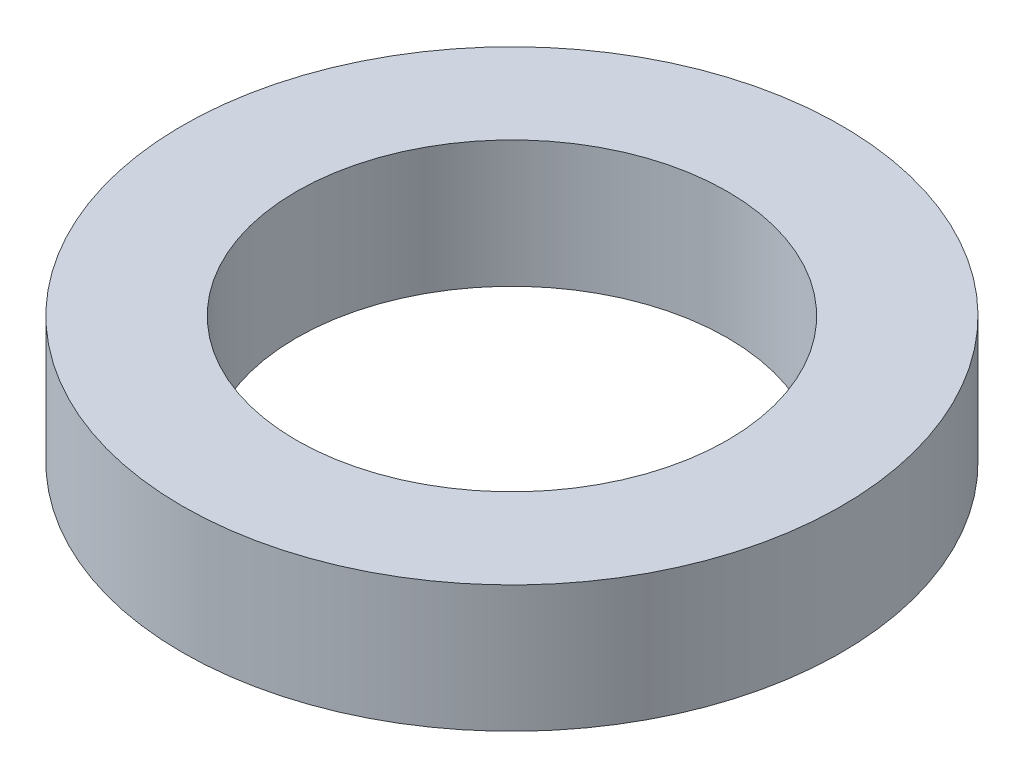
ISO-10303-21;
HEADER;
FILE_DESCRIPTION(('STEP AP214'),'2;1');
FILE_NAME('part.step','',(''),(''),'','','');
FILE_SCHEMA(('AUTOMOTIVE_DESIGN { 1 0 10303 214 1 1 1 1 }'));
ENDSEC;
DATA;
#1=APPLICATION_CONTEXT('core data for automotive mechanical design processes');
#2=APPLICATION_PROTOCOL_DEFINITION('international standard','automotive_design',2000,#1);
#3=PRODUCT_CONTEXT('',#1,'mechanical');
#4=PRODUCT('Part','Part','',(#3));
#5=PRODUCT_RELATED_PRODUCT_CATEGORY('part','',(#4));
#6=PRODUCT_DEFINITION_FORMATION('','',#4);
#7=PRODUCT_DEFINITION_CONTEXT('part definition',#1,'design');
#8=PRODUCT_DEFINITION('design','',#6,#7);
#9=PRODUCT_DEFINITION_SHAPE('','',#8);
#10=(LENGTH_UNIT() NAMED_UNIT(*) SI_UNIT(.MILLI.,.METRE.));
#11=(NAMED_UNIT(*) PLANE_ANGLE_UNIT() SI_UNIT($,.RADIAN.));
#12=(NAMED_UNIT(*) SI_UNIT($,.STERADIAN.) SOLID_ANGLE_UNIT());
#13=UNCERTAINTY_MEASURE_WITH_UNIT(LENGTH_MEASURE(1.E-05),#10,'distance_accuracy_value','');
#14=(GEOMETRIC_REPRESENTATION_CONTEXT(3) GLOBAL_UNCERTAINTY_ASSIGNED_CONTEXT((#13)) GLOBAL_UNIT_ASSIGNED_CONTEXT((#10,
#11,#12)) REPRESENTATION_CONTEXT('',''));
#15=CARTESIAN_POINT('',(0.,0.,0.));
#16=DIRECTION('',(0.,0.,1.));
#17=DIRECTION('',(1.,0.,0.));
#18=AXIS2_PLACEMENT_3D('',#15,#16,#17);
#19=CARTESIAN_POINT('',(0.,5.,0.));
#20=DIRECTION('',(0.,1.,0.));
#21=DIRECTION('',(0.,0.,1.));
#22=AXIS2_PLACEMENT_3D('',#19,#20,#21);
#23=PLANE('',#22);
#24=CARTESIAN_POINT('',(0.,5.,0.));
#25=DIRECTION('',(0.,1.,0.));
#26=DIRECTION('',(0.,0.,1.));
#27=AXIS2_PLACEMENT_3D('',#24,#25,#26);
#28=CIRCLE('',#27,13.);
#29=CARTESIAN_POINT('',(0.,5.,13.));
#30=VERTEX_POINT('',#29);
#31=EDGE_CURVE('E10',#30,#30,#28,.T.);
#32=ORIENTED_EDGE('',*,*,#31,.T.);
#33=EDGE_LOOP('',(#32));
#34=FACE_BOUND('',#33,.T.);
#35=CARTESIAN_POINT('',(0.,5.,0.));
#36=DIRECTION('',(0.,1.,0.));
#37=DIRECTION('',(0.,0.,1.));
#38=AXIS2_PLACEMENT_3D('',#35,#36,#37);
#39=CIRCLE('',#38,8.5);
#40=CARTESIAN_POINT('',(0.,5.,8.5));
#41=VERTEX_POINT('',#40);
#42=EDGE_CURVE('E50',#41,#41,#39,.T.);
#43=ORIENTED_EDGE('',*,*,#42,.F.);
#44=EDGE_LOOP('',(#43));
#45=FACE_BOUND('',#44,.T.);
#46=ADVANCED_FACE('F39',(#34,#45),#23,.T.);
#47=CARTESIAN_POINT('',(0.,0.,0.));
#48=DIRECTION('',(0.,1.,0.));
#49=DIRECTION('',(0.,0.,1.));
#50=AXIS2_PLACEMENT_3D('',#47,#48,#49);
#51=PLANE('',#50);
#52=CARTESIAN_POINT('',(0.,0.,0.));
#53=DIRECTION('',(0.,1.,0.));
#54=DIRECTION('',(0.,0.,1.));
#55=AXIS2_PLACEMENT_3D('',#52,#53,#54);
#56=CIRCLE('',#55,13.);
#57=CARTESIAN_POINT('',(0.,0.,13.));
#58=VERTEX_POINT('',#57);
#59=EDGE_CURVE('E43',#58,#58,#56,.T.);
#60=ORIENTED_EDGE('',*,*,#59,.F.);
#61=EDGE_LOOP('',(#60));
#62=FACE_BOUND('',#61,.T.);
#63=CARTESIAN_POINT('',(0.,0.,0.));
#64=DIRECTION('',(0.,1.,0.));
#65=DIRECTION('',(0.,0.,1.));
#66=AXIS2_PLACEMENT_3D('',#63,#64,#65);
#67=CIRCLE('',#66,8.5);
#68=CARTESIAN_POINT('',(0.,0.,8.5));
#69=VERTEX_POINT('',#68);
#70=EDGE_CURVE('E52',#69,#69,#67,.T.);
#71=ORIENTED_EDGE('',*,*,#70,.T.);
#72=EDGE_LOOP('',(#71));
#73=FACE_BOUND('',#72,.T.);
#74=ADVANCED_FACE('F62',(#62,#73),#51,.F.);
#75=CARTESIAN_POINT('',(0.,5.,0.));
#76=DIRECTION('',(0.,-1.,0.));
#77=DIRECTION('',(0.,0.,-1.));
#78=AXIS2_PLACEMENT_3D('',#75,#76,#77);
#79=CYLINDRICAL_SURFACE('',#78,13.);
#80=ORIENTED_EDGE('',*,*,#31,.F.);
#81=EDGE_LOOP('',(#80));
#82=FACE_BOUND('',#81,.T.);
#83=ORIENTED_EDGE('',*,*,#59,.T.);
#84=EDGE_LOOP('',(#83));
#85=FACE_BOUND('',#84,.T.);
#86=ADVANCED_FACE('F41',(#82,#85),#79,.T.);
#87=CARTESIAN_POINT('',(0.,5.,0.));
#88=DIRECTION('',(0.,-1.,0.));
#89=DIRECTION('',(0.,0.,-1.));
#90=AXIS2_PLACEMENT_3D('',#87,#88,#89);
#91=CYLINDRICAL_SURFACE('',#90,8.5);
#92=ORIENTED_EDGE('',*,*,#42,.T.);
#93=EDGE_LOOP('',(#92));
#94=FACE_BOUND('',#93,.T.);
#95=ORIENTED_EDGE('',*,*,#70,.F.);
#96=EDGE_LOOP('',(#95));
#97=FACE_BOUND('',#96,.T.);
#98=ADVANCED_FACE('F58',(#94,#97),#91,.F.);
#99=CLOSED_SHELL('',(#46,#74,#86,#98));
#100=MANIFOLD_SOLID_BREP('B2',#99);
#101=ADVANCED_BREP_SHAPE_REPRESENTATION('',(#18,#100),#14);
#102=SHAPE_DEFINITION_REPRESENTATION(#9,#101);
ENDSEC;
END-ISO-10303-21;
